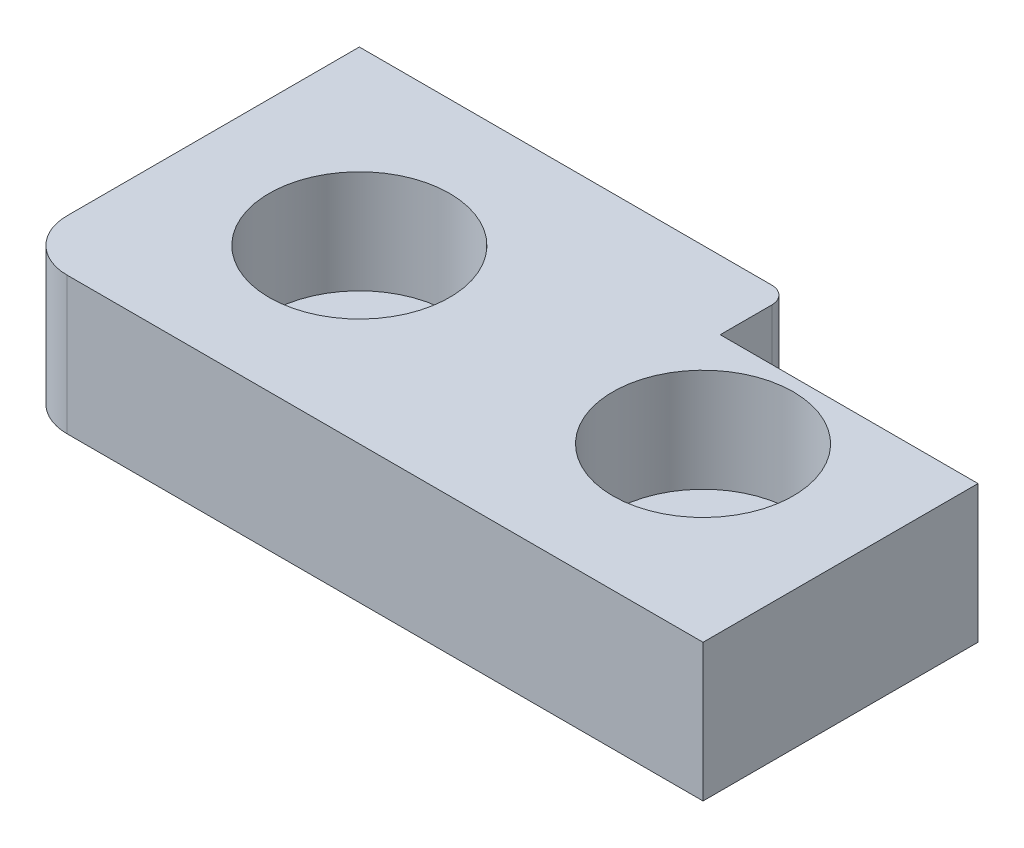
ISO-10303-21;
HEADER;
FILE_DESCRIPTION(('STEP AP214'),'2;1');
FILE_NAME('part.step','',(''),(''),'','','');
FILE_SCHEMA(('AUTOMOTIVE_DESIGN { 1 0 10303 214 1 1 1 1 }'));
ENDSEC;
DATA;
#1=APPLICATION_CONTEXT('core data for automotive mechanical design processes');
#2=APPLICATION_PROTOCOL_DEFINITION('international standard','automotive_design',2000,#1);
#3=PRODUCT_CONTEXT('',#1,'mechanical');
#4=PRODUCT('Part','Part','',(#3));
#5=PRODUCT_RELATED_PRODUCT_CATEGORY('part','',(#4));
#6=PRODUCT_DEFINITION_FORMATION('','',#4);
#7=PRODUCT_DEFINITION_CONTEXT('part definition',#1,'design');
#8=PRODUCT_DEFINITION('design','',#6,#7);
#9=PRODUCT_DEFINITION_SHAPE('','',#8);
#10=(LENGTH_UNIT() NAMED_UNIT(*) SI_UNIT(.MILLI.,.METRE.));
#11=(NAMED_UNIT(*) PLANE_ANGLE_UNIT() SI_UNIT($,.RADIAN.));
#12=(NAMED_UNIT(*) SI_UNIT($,.STERADIAN.) SOLID_ANGLE_UNIT());
#13=UNCERTAINTY_MEASURE_WITH_UNIT(LENGTH_MEASURE(1.E-05),#10,'distance_accuracy_value','');
#14=(GEOMETRIC_REPRESENTATION_CONTEXT(3) GLOBAL_UNCERTAINTY_ASSIGNED_CONTEXT((#13)) GLOBAL_UNIT_ASSIGNED_CONTEXT((#10,
#11,#12)) REPRESENTATION_CONTEXT('',''));
#15=CARTESIAN_POINT('',(0.,0.,0.));
#16=DIRECTION('',(0.,0.,1.));
#17=DIRECTION('',(1.,0.,0.));
#18=AXIS2_PLACEMENT_3D('',#15,#16,#17);
#19=CARTESIAN_POINT('',(40.,8.,-3.00000000000002));
#20=DIRECTION('',(-1.,0.,0.));
#21=DIRECTION('',(0.,0.,1.));
#22=AXIS2_PLACEMENT_3D('',#19,#20,#21);
#23=PLANE('',#22);
#24=DIRECTION('',(0.,0.,-1.));
#25=VECTOR('',#24,1.);
#26=CARTESIAN_POINT('',(40.,0.,-3.00000000000002));
#27=LINE('',#26,#25);
#28=CARTESIAN_POINT('',(40.,0.,0.));
#29=VERTEX_POINT('',#28);
#30=CARTESIAN_POINT('',(40.,0.,-16.));
#31=VERTEX_POINT('',#30);
#32=EDGE_CURVE('E133',#29,#31,#27,.T.);
#33=ORIENTED_EDGE('',*,*,#32,.T.);
#34=DIRECTION('',(0.,-1.,0.));
#35=VECTOR('',#34,1.);
#36=CARTESIAN_POINT('',(40.,8.,-16.));
#37=LINE('',#36,#35);
#38=CARTESIAN_POINT('',(40.,8.,-16.));
#39=VERTEX_POINT('',#38);
#40=EDGE_CURVE('E41',#39,#31,#37,.T.);
#41=ORIENTED_EDGE('',*,*,#40,.F.);
#42=DIRECTION('',(0.,0.,-1.));
#43=VECTOR('',#42,1.);
#44=CARTESIAN_POINT('',(40.,8.,0.));
#45=LINE('',#44,#43);
#46=CARTESIAN_POINT('',(40.,8.,0.));
#47=VERTEX_POINT('',#46);
#48=EDGE_CURVE('E93',#47,#39,#45,.T.);
#49=ORIENTED_EDGE('',*,*,#48,.F.);
#50=DIRECTION('',(0.,-1.,0.));
#51=VECTOR('',#50,1.);
#52=CARTESIAN_POINT('',(40.,8.,0.));
#53=LINE('',#52,#51);
#54=EDGE_CURVE('E11',#47,#29,#53,.T.);
#55=ORIENTED_EDGE('',*,*,#54,.T.);
#56=EDGE_LOOP('',(#33,#41,#49,#55));
#57=FACE_BOUND('',#56,.T.);
#58=ADVANCED_FACE('F33',(#57),#23,.F.);
#59=CARTESIAN_POINT('',(25.,8.,-16.));
#60=DIRECTION('',(0.,0.,1.));
#61=DIRECTION('',(1.,0.,0.));
#62=AXIS2_PLACEMENT_3D('',#59,#60,#61);
#63=PLANE('',#62);
#64=DIRECTION('',(-1.,0.,0.));
#65=VECTOR('',#64,1.);
#66=CARTESIAN_POINT('',(25.,0.,-16.));
#67=LINE('',#66,#65);
#68=CARTESIAN_POINT('',(25.,0.,-16.));
#69=VERTEX_POINT('',#68);
#70=EDGE_CURVE('E135',#31,#69,#67,.T.);
#71=ORIENTED_EDGE('',*,*,#70,.T.);
#72=DIRECTION('',(0.,-1.,0.));
#73=VECTOR('',#72,1.);
#74=CARTESIAN_POINT('',(25.,8.,-16.));
#75=LINE('',#74,#73);
#76=CARTESIAN_POINT('',(25.,8.,-16.));
#77=VERTEX_POINT('',#76);
#78=EDGE_CURVE('E154',#77,#69,#75,.T.);
#79=ORIENTED_EDGE('',*,*,#78,.F.);
#80=DIRECTION('',(-1.,0.,0.));
#81=VECTOR('',#80,1.);
#82=CARTESIAN_POINT('',(25.,8.,-16.));
#83=LINE('',#82,#81);
#84=EDGE_CURVE('E162',#39,#77,#83,.T.);
#85=ORIENTED_EDGE('',*,*,#84,.F.);
#86=ORIENTED_EDGE('',*,*,#40,.T.);
#87=EDGE_LOOP('',(#71,#79,#85,#86));
#88=FACE_BOUND('',#87,.T.);
#89=ADVANCED_FACE('F160',(#88),#63,.F.);
#90=CARTESIAN_POINT('',(25.,8.,-19.));
#91=DIRECTION('',(-1.,0.,0.));
#92=DIRECTION('',(0.,0.,1.));
#93=AXIS2_PLACEMENT_3D('',#90,#91,#92);
#94=PLANE('',#93);
#95=DIRECTION('',(0.,0.,-1.));
#96=VECTOR('',#95,1.);
#97=CARTESIAN_POINT('',(25.,0.,-19.));
#98=LINE('',#97,#96);
#99=CARTESIAN_POINT('',(25.,0.,-19.));
#100=VERTEX_POINT('',#99);
#101=EDGE_CURVE('E138',#69,#100,#98,.T.);
#102=ORIENTED_EDGE('',*,*,#101,.T.);
#103=DIRECTION('',(0.,-1.,0.));
#104=VECTOR('',#103,1.);
#105=CARTESIAN_POINT('',(25.,8.,-19.));
#106=LINE('',#105,#104);
#107=CARTESIAN_POINT('',(25.,8.,-19.));
#108=VERTEX_POINT('',#107);
#109=EDGE_CURVE('E151',#108,#100,#106,.T.);
#110=ORIENTED_EDGE('',*,*,#109,.F.);
#111=DIRECTION('',(0.,0.,-1.));
#112=VECTOR('',#111,1.);
#113=CARTESIAN_POINT('',(25.,8.,-19.));
#114=LINE('',#113,#112);
#115=EDGE_CURVE('E174',#77,#108,#114,.T.);
#116=ORIENTED_EDGE('',*,*,#115,.F.);
#117=ORIENTED_EDGE('',*,*,#78,.T.);
#118=EDGE_LOOP('',(#102,#110,#116,#117));
#119=FACE_BOUND('',#118,.T.);
#120=ADVANCED_FACE('F170',(#119),#94,.F.);
#121=CARTESIAN_POINT('',(24.,8.,-19.));
#122=DIRECTION('',(0.,-1.,0.));
#123=DIRECTION('',(0.,0.,-1.));
#124=AXIS2_PLACEMENT_3D('',#121,#122,#123);
#125=CYLINDRICAL_SURFACE('',#124,1.);
#126=CARTESIAN_POINT('',(24.,0.,-19.));
#127=DIRECTION('',(0.,1.,0.));
#128=DIRECTION('',(0.,0.,1.));
#129=AXIS2_PLACEMENT_3D('',#126,#127,#128);
#130=CIRCLE('',#129,1.);
#131=CARTESIAN_POINT('',(24.,0.,-20.));
#132=VERTEX_POINT('',#131);
#133=EDGE_CURVE('E140',#100,#132,#130,.T.);
#134=ORIENTED_EDGE('',*,*,#133,.T.);
#135=DIRECTION('',(0.,-1.,0.));
#136=VECTOR('',#135,1.);
#137=CARTESIAN_POINT('',(24.,8.,-20.));
#138=LINE('',#137,#136);
#139=CARTESIAN_POINT('',(24.,8.,-20.));
#140=VERTEX_POINT('',#139);
#141=EDGE_CURVE('E122',#140,#132,#138,.T.);
#142=ORIENTED_EDGE('',*,*,#141,.F.);
#143=CARTESIAN_POINT('',(24.,8.,-19.));
#144=DIRECTION('',(0.,1.,0.));
#145=DIRECTION('',(0.,0.,1.));
#146=AXIS2_PLACEMENT_3D('',#143,#144,#145);
#147=CIRCLE('',#146,1.);
#148=EDGE_CURVE('E113',#108,#140,#147,.T.);
#149=ORIENTED_EDGE('',*,*,#148,.F.);
#150=ORIENTED_EDGE('',*,*,#109,.T.);
#151=EDGE_LOOP('',(#134,#142,#149,#150));
#152=FACE_BOUND('',#151,.T.);
#153=ADVANCED_FACE('F173',(#152),#125,.T.);
#154=CARTESIAN_POINT('',(0.,8.,-20.));
#155=DIRECTION('',(0.,0.,1.));
#156=DIRECTION('',(1.,0.,0.));
#157=AXIS2_PLACEMENT_3D('',#154,#155,#156);
#158=PLANE('',#157);
#159=DIRECTION('',(-1.,0.,0.));
#160=VECTOR('',#159,1.);
#161=CARTESIAN_POINT('',(0.,0.,-20.));
#162=LINE('',#161,#160);
#163=CARTESIAN_POINT('',(0.,0.,-20.));
#164=VERTEX_POINT('',#163);
#165=EDGE_CURVE('E121',#132,#164,#162,.T.);
#166=ORIENTED_EDGE('',*,*,#165,.T.);
#167=DIRECTION('',(0.,-1.,0.));
#168=VECTOR('',#167,1.);
#169=CARTESIAN_POINT('',(0.,8.,-20.));
#170=LINE('',#169,#168);
#171=CARTESIAN_POINT('',(0.,8.,-20.));
#172=VERTEX_POINT('',#171);
#173=EDGE_CURVE('E118',#172,#164,#170,.T.);
#174=ORIENTED_EDGE('',*,*,#173,.F.);
#175=DIRECTION('',(-1.,0.,0.));
#176=VECTOR('',#175,1.);
#177=CARTESIAN_POINT('',(0.,8.,-20.));
#178=LINE('',#177,#176);
#179=EDGE_CURVE('E107',#140,#172,#178,.T.);
#180=ORIENTED_EDGE('',*,*,#179,.F.);
#181=ORIENTED_EDGE('',*,*,#141,.T.);
#182=EDGE_LOOP('',(#166,#174,#180,#181));
#183=FACE_BOUND('',#182,.T.);
#184=ADVANCED_FACE('F119',(#183),#158,.F.);
#185=CARTESIAN_POINT('',(0.,8.,-3.00000000000002));
#186=DIRECTION('',(1.,0.,0.));
#187=DIRECTION('',(0.,0.,-1.));
#188=AXIS2_PLACEMENT_3D('',#185,#186,#187);
#189=PLANE('',#188);
#190=DIRECTION('',(0.,0.,1.));
#191=VECTOR('',#190,1.);
#192=CARTESIAN_POINT('',(0.,0.,-3.00000000000002));
#193=LINE('',#192,#191);
#194=CARTESIAN_POINT('',(0.,0.,-3.00000000000002));
#195=VERTEX_POINT('',#194);
#196=EDGE_CURVE('E79',#164,#195,#193,.T.);
#197=ORIENTED_EDGE('',*,*,#196,.T.);
#198=DIRECTION('',(0.,-1.,0.));
#199=VECTOR('',#198,1.);
#200=CARTESIAN_POINT('',(0.,8.,-3.00000000000002));
#201=LINE('',#200,#199);
#202=CARTESIAN_POINT('',(0.,8.,-3.00000000000002));
#203=VERTEX_POINT('',#202);
#204=EDGE_CURVE('E123',#203,#195,#201,.T.);
#205=ORIENTED_EDGE('',*,*,#204,.F.);
#206=DIRECTION('',(0.,0.,1.));
#207=VECTOR('',#206,1.);
#208=CARTESIAN_POINT('',(0.,8.,-3.00000000000002));
#209=LINE('',#208,#207);
#210=EDGE_CURVE('E111',#172,#203,#209,.T.);
#211=ORIENTED_EDGE('',*,*,#210,.F.);
#212=ORIENTED_EDGE('',*,*,#173,.T.);
#213=EDGE_LOOP('',(#197,#205,#211,#212));
#214=FACE_BOUND('',#213,.T.);
#215=ADVANCED_FACE('F125',(#214),#189,.F.);
#216=CARTESIAN_POINT('',(3.,8.,-3.));
#217=DIRECTION('',(0.,-1.,0.));
#218=DIRECTION('',(0.,0.,-1.));
#219=AXIS2_PLACEMENT_3D('',#216,#217,#218);
#220=CYLINDRICAL_SURFACE('',#219,3.);
#221=CARTESIAN_POINT('',(3.,0.,-3.));
#222=DIRECTION('',(0.,1.,0.));
#223=DIRECTION('',(0.,0.,-1.));
#224=AXIS2_PLACEMENT_3D('',#221,#222,#223);
#225=CIRCLE('',#224,3.);
#226=CARTESIAN_POINT('',(3.00000000000002,0.,0.));
#227=VERTEX_POINT('',#226);
#228=EDGE_CURVE('E86',#195,#227,#225,.T.);
#229=ORIENTED_EDGE('',*,*,#228,.T.);
#230=DIRECTION('',(0.,-1.,0.));
#231=VECTOR('',#230,1.);
#232=CARTESIAN_POINT('',(3.00000000000002,8.,0.));
#233=LINE('',#232,#231);
#234=CARTESIAN_POINT('',(3.00000000000002,8.,0.));
#235=VERTEX_POINT('',#234);
#236=EDGE_CURVE('E129',#235,#227,#233,.T.);
#237=ORIENTED_EDGE('',*,*,#236,.F.);
#238=CARTESIAN_POINT('',(3.,8.,-3.));
#239=DIRECTION('',(0.,1.,0.));
#240=DIRECTION('',(0.,0.,-1.));
#241=AXIS2_PLACEMENT_3D('',#238,#239,#240);
#242=CIRCLE('',#241,3.);
#243=EDGE_CURVE('E127',#203,#235,#242,.T.);
#244=ORIENTED_EDGE('',*,*,#243,.F.);
#245=ORIENTED_EDGE('',*,*,#204,.T.);
#246=EDGE_LOOP('',(#229,#237,#244,#245));
#247=FACE_BOUND('',#246,.T.);
#248=ADVANCED_FACE('F233',(#247),#220,.T.);
#249=CARTESIAN_POINT('',(3.00000000000002,8.,0.));
#250=DIRECTION('',(0.,0.,-1.));
#251=DIRECTION('',(-1.,0.,0.));
#252=AXIS2_PLACEMENT_3D('',#249,#250,#251);
#253=PLANE('',#252);
#254=DIRECTION('',(1.,0.,0.));
#255=VECTOR('',#254,1.);
#256=CARTESIAN_POINT('',(3.00000000000002,0.,0.));
#257=LINE('',#256,#255);
#258=EDGE_CURVE('E145',#227,#29,#257,.T.);
#259=ORIENTED_EDGE('',*,*,#258,.T.);
#260=ORIENTED_EDGE('',*,*,#54,.F.);
#261=DIRECTION('',(1.,0.,0.));
#262=VECTOR('',#261,1.);
#263=CARTESIAN_POINT('',(37.,8.,0.));
#264=LINE('',#263,#262);
#265=EDGE_CURVE('E49',#235,#47,#264,.T.);
#266=ORIENTED_EDGE('',*,*,#265,.F.);
#267=ORIENTED_EDGE('',*,*,#236,.T.);
#268=EDGE_LOOP('',(#259,#260,#266,#267));
#269=FACE_BOUND('',#268,.T.);
#270=ADVANCED_FACE('F208',(#269),#253,.F.);
#271=CARTESIAN_POINT('',(24.,8.,-19.));
#272=DIRECTION('',(0.,1.,0.));
#273=DIRECTION('',(0.,0.,1.));
#274=AXIS2_PLACEMENT_3D('',#271,#272,#273);
#275=PLANE('',#274);
#276=CARTESIAN_POINT('',(30.,8.,-10.));
#277=DIRECTION('',(0.,1.,0.));
#278=DIRECTION('',(0.,0.,1.));
#279=AXIS2_PLACEMENT_3D('',#276,#277,#278);
#280=CIRCLE('',#279,5.24999999999999);
#281=CARTESIAN_POINT('',(30.,8.,-4.75000000000001));
#282=VERTEX_POINT('',#281);
#283=EDGE_CURVE('E200',#282,#282,#280,.T.);
#284=ORIENTED_EDGE('',*,*,#283,.F.);
#285=EDGE_LOOP('',(#284));
#286=FACE_BOUND('',#285,.T.);
#287=CARTESIAN_POINT('',(10.,8.,-10.));
#288=DIRECTION('',(0.,1.,0.));
#289=DIRECTION('',(0.,0.,1.));
#290=AXIS2_PLACEMENT_3D('',#287,#288,#289);
#291=CIRCLE('',#290,5.24999999999999);
#292=CARTESIAN_POINT('',(10.,8.,-4.75000000000001));
#293=VERTEX_POINT('',#292);
#294=EDGE_CURVE('E188',#293,#293,#291,.T.);
#295=ORIENTED_EDGE('',*,*,#294,.F.);
#296=EDGE_LOOP('',(#295));
#297=FACE_BOUND('',#296,.T.);
#298=ORIENTED_EDGE('',*,*,#265,.T.);
#299=ORIENTED_EDGE('',*,*,#48,.T.);
#300=ORIENTED_EDGE('',*,*,#84,.T.);
#301=ORIENTED_EDGE('',*,*,#115,.T.);
#302=ORIENTED_EDGE('',*,*,#148,.T.);
#303=ORIENTED_EDGE('',*,*,#179,.T.);
#304=ORIENTED_EDGE('',*,*,#210,.T.);
#305=ORIENTED_EDGE('',*,*,#243,.T.);
#306=EDGE_LOOP('',(#298,#299,#300,#301,#302,#303,#304,#305));
#307=FACE_BOUND('',#306,.T.);
#308=ADVANCED_FACE('F109',(#286,#297,#307),#275,.T.);
#309=CARTESIAN_POINT('',(24.,0.,-19.));
#310=DIRECTION('',(0.,1.,0.));
#311=DIRECTION('',(0.,0.,1.));
#312=AXIS2_PLACEMENT_3D('',#309,#310,#311);
#313=PLANE('',#312);
#314=CARTESIAN_POINT('',(30.,0.,-10.));
#315=DIRECTION('',(0.,1.,0.));
#316=DIRECTION('',(0.,0.,1.));
#317=AXIS2_PLACEMENT_3D('',#314,#315,#316);
#318=CIRCLE('',#317,2.75);
#319=CARTESIAN_POINT('',(30.,0.,-7.25));
#320=VERTEX_POINT('',#319);
#321=EDGE_CURVE('E191',#320,#320,#318,.T.);
#322=ORIENTED_EDGE('',*,*,#321,.T.);
#323=EDGE_LOOP('',(#322));
#324=FACE_BOUND('',#323,.T.);
#325=CARTESIAN_POINT('',(10.,0.,-10.));
#326=DIRECTION('',(0.,1.,0.));
#327=DIRECTION('',(0.,0.,1.));
#328=AXIS2_PLACEMENT_3D('',#325,#326,#327);
#329=CIRCLE('',#328,2.75);
#330=CARTESIAN_POINT('',(10.,0.,-7.25));
#331=VERTEX_POINT('',#330);
#332=EDGE_CURVE('E136',#331,#331,#329,.T.);
#333=ORIENTED_EDGE('',*,*,#332,.T.);
#334=EDGE_LOOP('',(#333));
#335=FACE_BOUND('',#334,.T.);
#336=ORIENTED_EDGE('',*,*,#32,.F.);
#337=ORIENTED_EDGE('',*,*,#258,.F.);
#338=ORIENTED_EDGE('',*,*,#228,.F.);
#339=ORIENTED_EDGE('',*,*,#196,.F.);
#340=ORIENTED_EDGE('',*,*,#165,.F.);
#341=ORIENTED_EDGE('',*,*,#133,.F.);
#342=ORIENTED_EDGE('',*,*,#101,.F.);
#343=ORIENTED_EDGE('',*,*,#70,.F.);
#344=EDGE_LOOP('',(#336,#337,#338,#339,#340,#341,#342,#343));
#345=FACE_BOUND('',#344,.T.);
#346=ADVANCED_FACE('F165',(#324,#335,#345),#313,.F.);
#347=CARTESIAN_POINT('',(10.,8.,-10.));
#348=DIRECTION('',(0.,1.,0.));
#349=DIRECTION('',(0.,0.,1.));
#350=AXIS2_PLACEMENT_3D('',#347,#348,#349);
#351=CYLINDRICAL_SURFACE('',#350,2.75);
#352=ORIENTED_EDGE('',*,*,#332,.F.);
#353=EDGE_LOOP('',(#352));
#354=FACE_BOUND('',#353,.T.);
#355=CARTESIAN_POINT('',(10.,2.,-10.));
#356=DIRECTION('',(0.,1.,0.));
#357=DIRECTION('',(0.,0.,1.));
#358=AXIS2_PLACEMENT_3D('',#355,#356,#357);
#359=CIRCLE('',#358,2.75);
#360=CARTESIAN_POINT('',(10.,2.,-7.25));
#361=VERTEX_POINT('',#360);
#362=EDGE_CURVE('E182',#361,#361,#359,.T.);
#363=ORIENTED_EDGE('',*,*,#362,.T.);
#364=EDGE_LOOP('',(#363));
#365=FACE_BOUND('',#364,.T.);
#366=ADVANCED_FACE('F225',(#354,#365),#351,.F.);
#367=CARTESIAN_POINT('',(12.75,2.,-10.));
#368=DIRECTION('',(0.,-1.,0.));
#369=DIRECTION('',(0.,0.,-1.));
#370=AXIS2_PLACEMENT_3D('',#367,#368,#369);
#371=PLANE('',#370);
#372=ORIENTED_EDGE('',*,*,#362,.F.);
#373=EDGE_LOOP('',(#372));
#374=FACE_BOUND('',#373,.T.);
#375=CARTESIAN_POINT('',(10.,2.,-10.));
#376=DIRECTION('',(0.,1.,0.));
#377=DIRECTION('',(0.,0.,1.));
#378=AXIS2_PLACEMENT_3D('',#375,#376,#377);
#379=CIRCLE('',#378,5.25);
#380=CARTESIAN_POINT('',(10.,2.,-4.75));
#381=VERTEX_POINT('',#380);
#382=EDGE_CURVE('E185',#381,#381,#379,.T.);
#383=ORIENTED_EDGE('',*,*,#382,.T.);
#384=EDGE_LOOP('',(#383));
#385=FACE_BOUND('',#384,.T.);
#386=ADVANCED_FACE('F215',(#374,#385),#371,.F.);
#387=CARTESIAN_POINT('',(10.,8.,-10.));
#388=DIRECTION('',(0.,1.,0.));
#389=DIRECTION('',(0.,0.,1.));
#390=AXIS2_PLACEMENT_3D('',#387,#388,#389);
#391=CYLINDRICAL_SURFACE('',#390,5.25);
#392=ORIENTED_EDGE('',*,*,#382,.F.);
#393=EDGE_LOOP('',(#392));
#394=FACE_BOUND('',#393,.T.);
#395=ORIENTED_EDGE('',*,*,#294,.T.);
#396=EDGE_LOOP('',(#395));
#397=FACE_BOUND('',#396,.T.);
#398=ADVANCED_FACE('F212',(#394,#397),#391,.F.);
#399=CARTESIAN_POINT('',(30.,8.,-10.));
#400=DIRECTION('',(0.,1.,0.));
#401=DIRECTION('',(0.,0.,1.));
#402=AXIS2_PLACEMENT_3D('',#399,#400,#401);
#403=CYLINDRICAL_SURFACE('',#402,2.75);
#404=ORIENTED_EDGE('',*,*,#321,.F.);
#405=EDGE_LOOP('',(#404));
#406=FACE_BOUND('',#405,.T.);
#407=CARTESIAN_POINT('',(30.,2.,-10.));
#408=DIRECTION('',(0.,1.,0.));
#409=DIRECTION('',(0.,0.,1.));
#410=AXIS2_PLACEMENT_3D('',#407,#408,#409);
#411=CIRCLE('',#410,2.75);
#412=CARTESIAN_POINT('',(30.,2.,-7.25));
#413=VERTEX_POINT('',#412);
#414=EDGE_CURVE('E194',#413,#413,#411,.T.);
#415=ORIENTED_EDGE('',*,*,#414,.T.);
#416=EDGE_LOOP('',(#415));
#417=FACE_BOUND('',#416,.T.);
#418=ADVANCED_FACE('F214',(#406,#417),#403,.F.);
#419=CARTESIAN_POINT('',(32.75,2.,-10.));
#420=DIRECTION('',(0.,-1.,0.));
#421=DIRECTION('',(0.,0.,-1.));
#422=AXIS2_PLACEMENT_3D('',#419,#420,#421);
#423=PLANE('',#422);
#424=ORIENTED_EDGE('',*,*,#414,.F.);
#425=EDGE_LOOP('',(#424));
#426=FACE_BOUND('',#425,.T.);
#427=CARTESIAN_POINT('',(30.,2.,-10.));
#428=DIRECTION('',(0.,1.,0.));
#429=DIRECTION('',(0.,0.,1.));
#430=AXIS2_PLACEMENT_3D('',#427,#428,#429);
#431=CIRCLE('',#430,5.25);
#432=CARTESIAN_POINT('',(30.,2.,-4.75));
#433=VERTEX_POINT('',#432);
#434=EDGE_CURVE('E197',#433,#433,#431,.T.);
#435=ORIENTED_EDGE('',*,*,#434,.T.);
#436=EDGE_LOOP('',(#435));
#437=FACE_BOUND('',#436,.T.);
#438=ADVANCED_FACE('F222',(#426,#437),#423,.F.);
#439=CARTESIAN_POINT('',(30.,8.,-10.));
#440=DIRECTION('',(0.,1.,0.));
#441=DIRECTION('',(0.,0.,1.));
#442=AXIS2_PLACEMENT_3D('',#439,#440,#441);
#443=CYLINDRICAL_SURFACE('',#442,5.24999999999999);
#444=ORIENTED_EDGE('',*,*,#434,.F.);
#445=EDGE_LOOP('',(#444));
#446=FACE_BOUND('',#445,.T.);
#447=ORIENTED_EDGE('',*,*,#283,.T.);
#448=EDGE_LOOP('',(#447));
#449=FACE_BOUND('',#448,.T.);
#450=ADVANCED_FACE('F204',(#446,#449),#443,.F.);
#451=CLOSED_SHELL('',(#58,#89,#120,#153,#184,#215,#248,#270,#308,#346,#366,#386,#398,#418,#438,#450));
#452=MANIFOLD_SOLID_BREP('B2',#451);
#453=ADVANCED_BREP_SHAPE_REPRESENTATION('',(#18,#452),#14);
#454=SHAPE_DEFINITION_REPRESENTATION(#9,#453);
ENDSEC;
END-ISO-10303-21;
